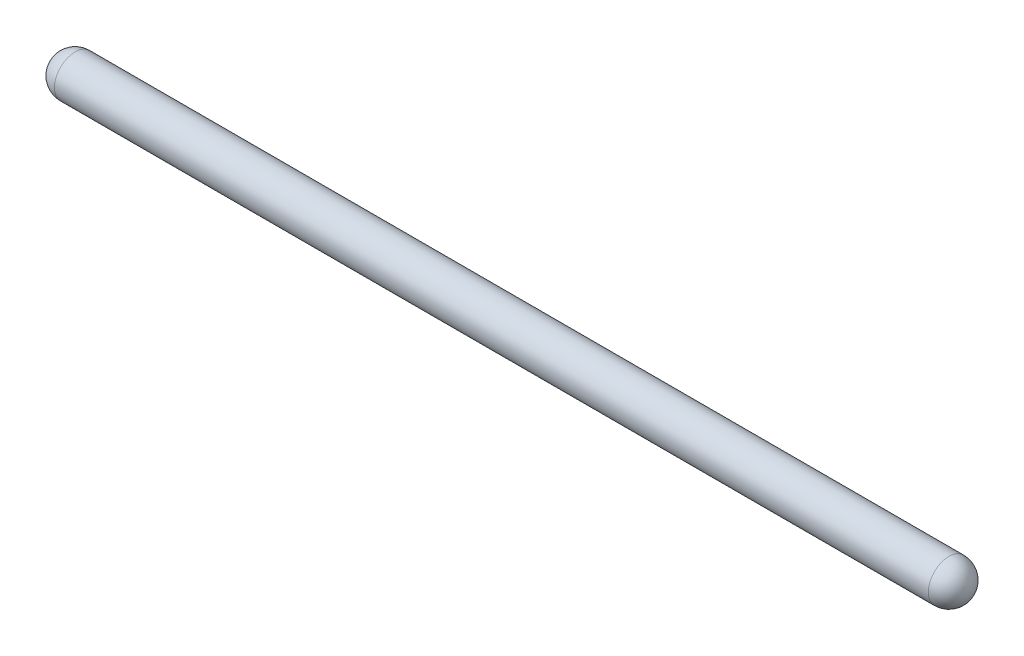
ISO-10303-21;
HEADER;
FILE_DESCRIPTION(('STEP AP214'),'2;1');
FILE_NAME('part.step','',(''),(''),'','','');
FILE_SCHEMA(('AUTOMOTIVE_DESIGN { 1 0 10303 214 1 1 1 1 }'));
ENDSEC;
DATA;
#1=APPLICATION_CONTEXT('core data for automotive mechanical design processes');
#2=APPLICATION_PROTOCOL_DEFINITION('international standard','automotive_design',2000,#1);
#3=PRODUCT_CONTEXT('',#1,'mechanical');
#4=PRODUCT('Part','Part','',(#3));
#5=PRODUCT_RELATED_PRODUCT_CATEGORY('part','',(#4));
#6=PRODUCT_DEFINITION_FORMATION('','',#4);
#7=PRODUCT_DEFINITION_CONTEXT('part definition',#1,'design');
#8=PRODUCT_DEFINITION('design','',#6,#7);
#9=PRODUCT_DEFINITION_SHAPE('','',#8);
#10=(LENGTH_UNIT() NAMED_UNIT(*) SI_UNIT(.MILLI.,.METRE.));
#11=(NAMED_UNIT(*) PLANE_ANGLE_UNIT() SI_UNIT($,.RADIAN.));
#12=(NAMED_UNIT(*) SI_UNIT($,.STERADIAN.) SOLID_ANGLE_UNIT());
#13=UNCERTAINTY_MEASURE_WITH_UNIT(LENGTH_MEASURE(1.E-05),#10,'distance_accuracy_value','');
#14=(GEOMETRIC_REPRESENTATION_CONTEXT(3) GLOBAL_UNCERTAINTY_ASSIGNED_CONTEXT((#13)) GLOBAL_UNIT_ASSIGNED_CONTEXT((#10,
#11,#12)) REPRESENTATION_CONTEXT('',''));
#15=CARTESIAN_POINT('',(0.,0.,0.));
#16=DIRECTION('',(0.,0.,1.));
#17=DIRECTION('',(1.,0.,0.));
#18=AXIS2_PLACEMENT_3D('',#15,#16,#17);
#19=CARTESIAN_POINT('',(0.,0.,0.));
#20=DIRECTION('',(-1.,0.,0.));
#21=DIRECTION('',(0.,1.,0.));
#22=AXIS2_PLACEMENT_3D('',#19,#20,#21);
#23=SPHERICAL_SURFACE('',#22,1.5);
#24=CARTESIAN_POINT('',(0.,0.,0.));
#25=DIRECTION('',(-1.,0.,0.));
#26=DIRECTION('',(0.,0.,1.));
#27=AXIS2_PLACEMENT_3D('',#24,#25,#26);
#28=CIRCLE('',#27,1.5);
#29=CARTESIAN_POINT('',(0.,0.,1.5));
#30=VERTEX_POINT('',#29);
#31=EDGE_CURVE('E41',#30,#30,#28,.T.);
#32=ORIENTED_EDGE('',*,*,#31,.T.);
#33=EDGE_LOOP('',(#32));
#34=FACE_BOUND('',#33,.T.);
#35=ADVANCED_FACE('F34',(#34),#23,.T.);
#36=CARTESIAN_POINT('',(63.5,0.,0.));
#37=DIRECTION('',(-1.,0.,0.));
#38=DIRECTION('',(0.,1.,0.));
#39=AXIS2_PLACEMENT_3D('',#36,#37,#38);
#40=SPHERICAL_SURFACE('',#39,1.5);
#41=CARTESIAN_POINT('',(63.5,0.,0.));
#42=DIRECTION('',(-1.,0.,0.));
#43=DIRECTION('',(0.,0.,1.));
#44=AXIS2_PLACEMENT_3D('',#41,#42,#43);
#45=CIRCLE('',#44,1.5);
#46=CARTESIAN_POINT('',(63.5,0.,1.5));
#47=VERTEX_POINT('',#46);
#48=EDGE_CURVE('E10',#47,#47,#45,.T.);
#49=ORIENTED_EDGE('',*,*,#48,.F.);
#50=EDGE_LOOP('',(#49));
#51=FACE_BOUND('',#50,.T.);
#52=ADVANCED_FACE('F51',(#51),#40,.T.);
#53=CARTESIAN_POINT('',(0.,0.,0.));
#54=DIRECTION('',(-1.,0.,0.));
#55=DIRECTION('',(0.,0.,1.));
#56=AXIS2_PLACEMENT_3D('',#53,#54,#55);
#57=CYLINDRICAL_SURFACE('',#56,1.5);
#58=ORIENTED_EDGE('',*,*,#31,.F.);
#59=EDGE_LOOP('',(#58));
#60=FACE_BOUND('',#59,.T.);
#61=ORIENTED_EDGE('',*,*,#48,.T.);
#62=EDGE_LOOP('',(#61));
#63=FACE_BOUND('',#62,.T.);
#64=ADVANCED_FACE('F49',(#60,#63),#57,.T.);
#65=CLOSED_SHELL('',(#35,#52,#64));
#66=MANIFOLD_SOLID_BREP('B2',#65);
#67=ADVANCED_BREP_SHAPE_REPRESENTATION('',(#18,#66),#14);
#68=SHAPE_DEFINITION_REPRESENTATION(#9,#67);
ENDSEC;
END-ISO-10303-21;
